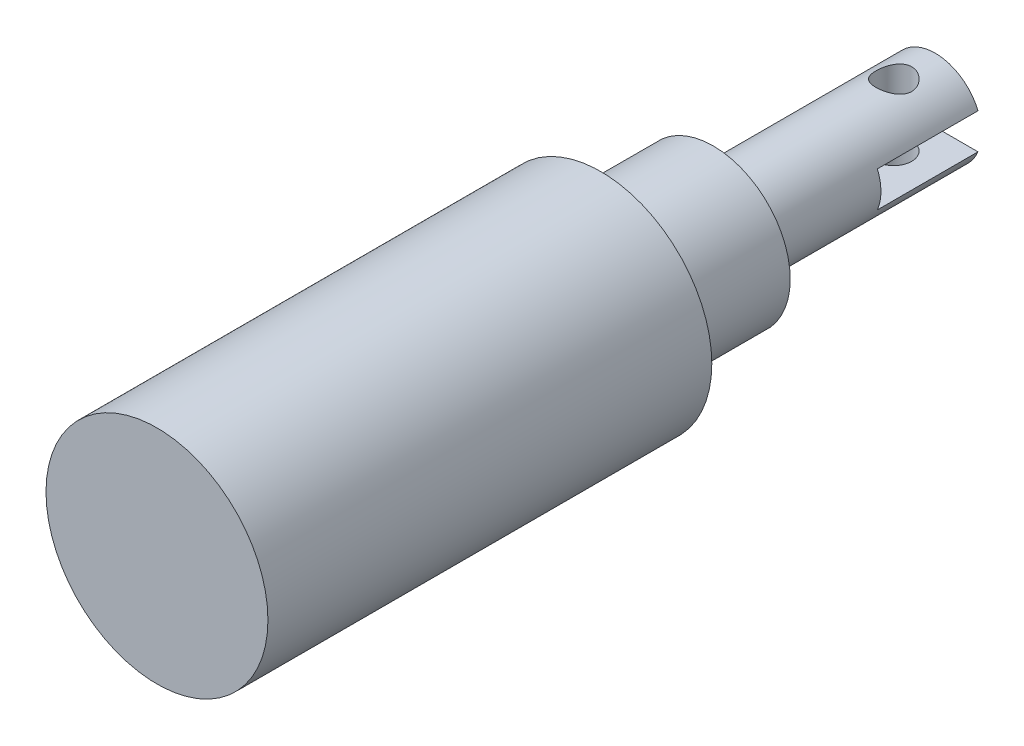
ISO-10303-21;
HEADER;
FILE_DESCRIPTION(('STEP AP214'),'2;1');
FILE_NAME('part.step','',(''),(''),'','','');
FILE_SCHEMA(('AUTOMOTIVE_DESIGN { 1 0 10303 214 1 1 1 1 }'));
ENDSEC;
DATA;
#1=APPLICATION_CONTEXT('core data for automotive mechanical design processes');
#2=APPLICATION_PROTOCOL_DEFINITION('international standard','automotive_design',2000,#1);
#3=PRODUCT_CONTEXT('',#1,'mechanical');
#4=PRODUCT('Part','Part','',(#3));
#5=PRODUCT_RELATED_PRODUCT_CATEGORY('part','',(#4));
#6=PRODUCT_DEFINITION_FORMATION('','',#4);
#7=PRODUCT_DEFINITION_CONTEXT('part definition',#1,'design');
#8=PRODUCT_DEFINITION('design','',#6,#7);
#9=PRODUCT_DEFINITION_SHAPE('','',#8);
#10=(LENGTH_UNIT() NAMED_UNIT(*) SI_UNIT(.MILLI.,.METRE.));
#11=(NAMED_UNIT(*) PLANE_ANGLE_UNIT() SI_UNIT($,.RADIAN.));
#12=(NAMED_UNIT(*) SI_UNIT($,.STERADIAN.) SOLID_ANGLE_UNIT());
#13=UNCERTAINTY_MEASURE_WITH_UNIT(LENGTH_MEASURE(1.E-05),#10,'distance_accuracy_value','');
#14=(GEOMETRIC_REPRESENTATION_CONTEXT(3) GLOBAL_UNCERTAINTY_ASSIGNED_CONTEXT((#13)) GLOBAL_UNIT_ASSIGNED_CONTEXT((#10,
#11,#12)) REPRESENTATION_CONTEXT('',''));
#15=CARTESIAN_POINT('',(0.,0.,0.));
#16=DIRECTION('',(0.,0.,1.));
#17=DIRECTION('',(1.,0.,0.));
#18=AXIS2_PLACEMENT_3D('',#15,#16,#17);
#19=CARTESIAN_POINT('',(0.,0.,-28.702));
#20=DIRECTION('',(0.,0.,-1.));
#21=DIRECTION('',(-1.,0.,0.));
#22=AXIS2_PLACEMENT_3D('',#19,#20,#21);
#23=PLANE('',#22);
#24=DIRECTION('',(1.,0.,0.));
#25=VECTOR('',#24,1.);
#26=CARTESIAN_POINT('',(0.,1.524,-28.702));
#27=LINE('',#26,#25);
#28=CARTESIAN_POINT('',(-3.67135451979239,1.524,-28.702));
#29=VERTEX_POINT('',#28);
#30=CARTESIAN_POINT('',(3.67135451979239,1.524,-28.702));
#31=VERTEX_POINT('',#30);
#32=EDGE_CURVE('E80',#29,#31,#27,.T.);
#33=ORIENTED_EDGE('',*,*,#32,.F.);
#34=CARTESIAN_POINT('',(0.,0.,-28.702));
#35=DIRECTION('',(0.,0.,-1.));
#36=DIRECTION('',(-1.,0.,0.));
#37=AXIS2_PLACEMENT_3D('',#34,#35,#36);
#38=CIRCLE('',#37,3.9751);
#39=EDGE_CURVE('E93',#29,#31,#38,.T.);
#40=ORIENTED_EDGE('',*,*,#39,.T.);
#41=EDGE_LOOP('',(#33,#40));
#42=FACE_BOUND('',#41,.T.);
#43=ADVANCED_FACE('F32',(#42),#23,.T.);
#44=CARTESIAN_POINT('',(0.,0.,-9.652));
#45=DIRECTION('',(0.,0.,-1.));
#46=DIRECTION('',(-1.,0.,0.));
#47=AXIS2_PLACEMENT_3D('',#44,#45,#46);
#48=PLANE('',#47);
#49=CARTESIAN_POINT('',(0.,0.,-9.652));
#50=DIRECTION('',(0.,0.,-1.));
#51=DIRECTION('',(-1.,0.,0.));
#52=AXIS2_PLACEMENT_3D('',#49,#50,#51);
#53=CIRCLE('',#52,6.604);
#54=CARTESIAN_POINT('',(-6.604,0.,-9.652));
#55=VERTEX_POINT('',#54);
#56=EDGE_CURVE('E97',#55,#55,#53,.T.);
#57=ORIENTED_EDGE('',*,*,#56,.T.);
#58=EDGE_LOOP('',(#57));
#59=FACE_BOUND('',#58,.T.);
#60=CARTESIAN_POINT('',(0.,0.,-9.652));
#61=DIRECTION('',(0.,0.,-1.));
#62=DIRECTION('',(-1.,0.,0.));
#63=AXIS2_PLACEMENT_3D('',#60,#61,#62);
#64=CIRCLE('',#63,3.9751);
#65=CARTESIAN_POINT('',(-3.9751,0.,-9.652));
#66=VERTEX_POINT('',#65);
#67=EDGE_CURVE('E94',#66,#66,#64,.T.);
#68=ORIENTED_EDGE('',*,*,#67,.F.);
#69=EDGE_LOOP('',(#68));
#70=FACE_BOUND('',#69,.T.);
#71=ADVANCED_FACE('F159',(#59,#70),#48,.T.);
#72=CARTESIAN_POINT('',(0.,0.,0.));
#73=DIRECTION('',(0.,0.,1.));
#74=DIRECTION('',(1.,0.,0.));
#75=AXIS2_PLACEMENT_3D('',#72,#73,#74);
#76=PLANE('',#75);
#77=CARTESIAN_POINT('',(0.,0.,0.));
#78=DIRECTION('',(0.,0.,1.));
#79=DIRECTION('',(1.,0.,0.));
#80=AXIS2_PLACEMENT_3D('',#77,#78,#79);
#81=CIRCLE('',#80,9.525);
#82=CARTESIAN_POINT('',(9.525,0.,0.));
#83=VERTEX_POINT('',#82);
#84=EDGE_CURVE('E105',#83,#83,#81,.T.);
#85=ORIENTED_EDGE('',*,*,#84,.F.);
#86=EDGE_LOOP('',(#85));
#87=FACE_BOUND('',#86,.T.);
#88=CARTESIAN_POINT('',(0.,0.,0.));
#89=DIRECTION('',(0.,0.,1.));
#90=DIRECTION('',(1.,0.,0.));
#91=AXIS2_PLACEMENT_3D('',#88,#89,#90);
#92=CIRCLE('',#91,6.604);
#93=CARTESIAN_POINT('',(6.604,0.,0.));
#94=VERTEX_POINT('',#93);
#95=EDGE_CURVE('E81',#94,#94,#92,.F.);
#96=ORIENTED_EDGE('',*,*,#95,.F.);
#97=EDGE_LOOP('',(#96));
#98=FACE_BOUND('',#97,.T.);
#99=ADVANCED_FACE('F164',(#87,#98),#76,.F.);
#100=CARTESIAN_POINT('',(0.,0.,38.1));
#101=DIRECTION('',(0.,0.,-1.));
#102=DIRECTION('',(-1.,0.,0.));
#103=AXIS2_PLACEMENT_3D('',#100,#101,#102);
#104=CYLINDRICAL_SURFACE('',#103,9.525);
#105=CARTESIAN_POINT('',(0.,0.,38.1));
#106=DIRECTION('',(0.,0.,1.));
#107=DIRECTION('',(1.,0.,0.));
#108=AXIS2_PLACEMENT_3D('',#105,#106,#107);
#109=CIRCLE('',#108,9.525);
#110=CARTESIAN_POINT('',(9.525,0.,38.1));
#111=VERTEX_POINT('',#110);
#112=EDGE_CURVE('E108',#111,#111,#109,.T.);
#113=ORIENTED_EDGE('',*,*,#112,.F.);
#114=EDGE_LOOP('',(#113));
#115=FACE_BOUND('',#114,.T.);
#116=ORIENTED_EDGE('',*,*,#84,.T.);
#117=EDGE_LOOP('',(#116));
#118=FACE_BOUND('',#117,.T.);
#119=ADVANCED_FACE('F34',(#115,#118),#104,.T.);
#120=CARTESIAN_POINT('',(0.,0.,38.1));
#121=DIRECTION('',(0.,0.,1.));
#122=DIRECTION('',(1.,0.,0.));
#123=AXIS2_PLACEMENT_3D('',#120,#121,#122);
#124=PLANE('',#123);
#125=ORIENTED_EDGE('',*,*,#112,.T.);
#126=EDGE_LOOP('',(#125));
#127=FACE_BOUND('',#126,.T.);
#128=ADVANCED_FACE('F174',(#127),#124,.T.);
#129=CARTESIAN_POINT('',(0.,0.,-9.652));
#130=DIRECTION('',(0.,0.,1.));
#131=DIRECTION('',(1.,0.,0.));
#132=AXIS2_PLACEMENT_3D('',#129,#130,#131);
#133=CYLINDRICAL_SURFACE('',#132,6.604);
#134=ORIENTED_EDGE('',*,*,#56,.F.);
#135=EDGE_LOOP('',(#134));
#136=FACE_BOUND('',#135,.T.);
#137=ORIENTED_EDGE('',*,*,#95,.T.);
#138=EDGE_LOOP('',(#137));
#139=FACE_BOUND('',#138,.T.);
#140=ADVANCED_FACE('F156',(#136,#139),#133,.T.);
#141=CARTESIAN_POINT('',(0.,0.,-28.702));
#142=DIRECTION('',(0.,0.,1.));
#143=DIRECTION('',(1.,0.,0.));
#144=AXIS2_PLACEMENT_3D('',#141,#142,#143);
#145=CYLINDRICAL_SURFACE('',#144,3.9751);
#146=CARTESIAN_POINT('',(0.,-3.9751,-23.6093));
#147=CARTESIAN_POINT('',(0.0830380894982347,-3.9751029806938,-23.6092961033103));
#148=CARTESIAN_POINT('',(0.166050383267687,-3.97247584886368,-23.6160513642807));
#149=CARTESIAN_POINT('',(0.329584181311895,-3.96225958594963,-23.6427763788338));
#150=CARTESIAN_POINT('',(0.410106208687314,-3.95467150447033,-23.6627433371844));
#151=CARTESIAN_POINT('',(0.566276493378778,-3.93534477224999,-23.715073348993));
#152=CARTESIAN_POINT('',(0.641934158795291,-3.92361443706282,-23.7474115779492));
#153=CARTESIAN_POINT('',(0.786742101338885,-3.89716328569474,-23.8234357791034));
#154=CARTESIAN_POINT('',(0.855890516440798,-3.88244161759914,-23.8671249849853));
#155=CARTESIAN_POINT('',(0.988809285528758,-3.85078346873806,-23.9666478095951));
#156=CARTESIAN_POINT('',(1.05225057511994,-3.83378163796224,-24.0228999128649));
#157=CARTESIAN_POINT('',(1.16906783530413,-3.79979056415889,-24.1450633450638));
#158=CARTESIAN_POINT('',(1.2224404378886,-3.78280132723024,-24.2109778930563));
#159=CARTESIAN_POINT('',(1.31976391728373,-3.74998579233273,-24.3538868073146));
#160=CARTESIAN_POINT('',(1.36323872732565,-3.73423574426588,-24.4312246670783));
#161=CARTESIAN_POINT('',(1.4364168594696,-3.70670563656035,-24.592817856327));
#162=CARTESIAN_POINT('',(1.46612607567058,-3.69492387838578,-24.677070206968));
#163=CARTESIAN_POINT('',(1.50961201037139,-3.67736636399404,-24.8463041896061));
#164=CARTESIAN_POINT('',(1.52401948364219,-3.67135391407232,-24.931098328155));
#165=CARTESIAN_POINT('',(1.5384644750005,-3.665325991539,-25.1020975576534));
#166=CARTESIAN_POINT('',(1.5385084162159,-3.66530783837952,-25.1883020006915));
#167=CARTESIAN_POINT('',(1.52470535473133,-3.67106749029638,-25.3537747457893));
#168=CARTESIAN_POINT('',(1.51175051657555,-3.67647304141678,-25.4331328814722));
#169=CARTESIAN_POINT('',(1.47379833169538,-3.69184957167249,-25.5884461994993));
#170=CARTESIAN_POINT('',(1.44879905310381,-3.70182128318405,-25.6644008338024));
#171=CARTESIAN_POINT('',(1.38700403741426,-3.72541918812199,-25.8125088409953));
#172=CARTESIAN_POINT('',(1.34998633026831,-3.73911328823974,-25.8845583027187));
#173=CARTESIAN_POINT('',(1.26536042569286,-3.76859217903469,-26.0216749238049));
#174=CARTESIAN_POINT('',(1.21774841540283,-3.78437772158667,-26.0867395568175));
#175=CARTESIAN_POINT('',(1.10926459633293,-3.81764207808103,-26.2129533862858));
#176=CARTESIAN_POINT('',(1.04768632189708,-3.8351611028321,-26.2734863123813));
#177=CARTESIAN_POINT('',(0.915057315823779,-3.86894932284617,-26.3835559647981));
#178=CARTESIAN_POINT('',(0.844004943543562,-3.88521830086596,-26.433090782593));
#179=CARTESIAN_POINT('',(0.692792686158952,-3.91503390905353,-26.520495718632));
#180=CARTESIAN_POINT('',(0.612496148411962,-3.92852839645976,-26.558148491541));
#181=CARTESIAN_POINT('',(0.446055800553947,-3.95088451493021,-26.6192033656615));
#182=CARTESIAN_POINT('',(0.359914778750758,-3.95974833789132,-26.6426122100161));
#183=CARTESIAN_POINT('',(0.189407865526704,-3.97145261179298,-26.6733019493625));
#184=CARTESIAN_POINT('',(0.105212322456653,-3.97460232999082,-26.6814119426118));
#185=CARTESIAN_POINT('',(-0.0633865089390949,-3.97548764711835,-26.6837034413665));
#186=CARTESIAN_POINT('',(-0.147789742923662,-3.97322453723792,-26.6778882686164));
#187=CARTESIAN_POINT('',(-0.310745600504053,-3.96374191093432,-26.6531156092067));
#188=CARTESIAN_POINT('',(-0.389395821774841,-3.95673125929177,-26.6347116268862));
#189=CARTESIAN_POINT('',(-0.542428899752999,-3.93867137326789,-26.5860236375393));
#190=CARTESIAN_POINT('',(-0.616811202090119,-3.92762161560513,-26.5557380911743));
#191=CARTESIAN_POINT('',(-0.761702917083166,-3.90215385006175,-26.4831678452456));
#192=CARTESIAN_POINT('',(-0.83202912344978,-3.88764471494833,-26.4405503358335));
#193=CARTESIAN_POINT('',(-0.964773399877488,-3.85684886036941,-26.3448987324591));
#194=CARTESIAN_POINT('',(-1.02718841276093,-3.84056145821401,-26.2918606316626));
#195=CARTESIAN_POINT('',(-1.14637181915741,-3.80674721919624,-26.1730288323215));
#196=CARTESIAN_POINT('',(-1.20255429098789,-3.78920590883894,-26.1066500616832));
#197=CARTESIAN_POINT('',(-1.30311142899317,-3.75581359694204,-25.965076563306));
#198=CARTESIAN_POINT('',(-1.34748465650101,-3.73996280149106,-25.8898807630342));
#199=CARTESIAN_POINT('',(-1.42330939759957,-3.71177394459548,-25.7319643908416));
#200=CARTESIAN_POINT('',(-1.45467465840069,-3.69945949220477,-25.6491978973582));
#201=CARTESIAN_POINT('',(-1.50279969909284,-3.68017636919458,-25.4789438370654));
#202=CARTESIAN_POINT('',(-1.51956929909603,-3.67320410467416,-25.3914594866284));
#203=CARTESIAN_POINT('',(-1.53712104106077,-3.66589154637158,-25.2206460734946));
#204=CARTESIAN_POINT('',(-1.53891039165668,-3.6651335118221,-25.1374376284623));
#205=CARTESIAN_POINT('',(-1.52906083673222,-3.66925348245713,-24.9719696492659));
#206=CARTESIAN_POINT('',(-1.51742337900248,-3.67413087998236,-24.8897100137592));
#207=CARTESIAN_POINT('',(-1.48185285694508,-3.68861475037555,-24.7313672590042));
#208=CARTESIAN_POINT('',(-1.45835766006208,-3.69805233538713,-24.6551689664657));
#209=CARTESIAN_POINT('',(-1.4001350818281,-3.72048520812047,-24.5077576051675));
#210=CARTESIAN_POINT('',(-1.36540478108963,-3.73348142039941,-24.4365458379893));
#211=CARTESIAN_POINT('',(-1.28349674615039,-3.76245117349394,-24.2968885113173));
#212=CARTESIAN_POINT('',(-1.23574193058826,-3.77854871045546,-24.2288074854954));
#213=CARTESIAN_POINT('',(-1.13001062675685,-3.81150365272091,-24.1013050558573));
#214=CARTESIAN_POINT('',(-1.07203078869622,-3.82836130569309,-24.0418865016182));
#215=CARTESIAN_POINT('',(-0.943415859281925,-3.86213076265507,-23.9298148872565));
#216=CARTESIAN_POINT('',(-0.872236257382769,-3.8789871869923,-23.8777670658039));
#217=CARTESIAN_POINT('',(-0.721544712543524,-3.90982159606638,-23.7863726296693));
#218=CARTESIAN_POINT('',(-0.642031215521395,-3.92379904249319,-23.7470283895182));
#219=CARTESIAN_POINT('',(-0.471012896609513,-3.94810315731587,-23.6801928342344));
#220=CARTESIAN_POINT('',(-0.379058426185178,-3.95810660587897,-23.6537214590898));
#221=CARTESIAN_POINT('',(-0.191389724843978,-3.97160139486835,-23.6182824346457));
#222=CARTESIAN_POINT('',(-0.0956777392224007,-3.97509656559965,-23.6093044898247));
#223=CARTESIAN_POINT('',(0.,-3.9751,-23.6093));
#224=B_SPLINE_CURVE_WITH_KNOTS('',3,(#146,#147,#148,#149,#150,#151,#152,#153,#154,#155,#156,
#157,#158,#159,#160,#161,#162,#163,#164,#165,#166,#167,#168,#169,#170,#171,#172,#173,#174,#175,
#176,#177,#178,#179,#180,#181,#182,#183,#184,#185,#186,#187,#188,#189,#190,#191,#192,#193,#194,
#195,#196,#197,#198,#199,#200,#201,#202,#203,#204,#205,#206,#207,#208,#209,#210,#211,#212,#213,
#214,#215,#216,#217,#218,#219,#220,#221,#222,#223),.UNSPECIFIED.,.T.,.F.,(4,2,2,2,2,2,2,2,2,2,2,
2,2,2,2,2,2,2,2,2,2,2,2,2,2,2,2,2,2,2,2,2,2,2,2,2,2,2,4),(0.,0.248761156411061,
0.497469698620771,0.745681771788006,0.993964633678405,1.25225386807937,1.51062934846253,
1.77959928462661,2.04845394761117,2.30573600720731,2.56290301447303,2.80354976797622,
3.04423513285523,3.28964601298231,3.53514535907688,3.79826634015716,4.06143294558598,
4.32916650826577,4.59677322580282,4.8494069791102,5.10198047452511,5.34410770606109,
5.58626631721738,5.83569188060921,6.08521353928717,6.35012915480844,6.61507702904576,
6.88175465737973,7.14825272322924,7.39667549323656,7.6450714787292,7.88490126299054,
8.12479341598759,8.37781108018318,8.63091178930224,8.89893144764616,9.16700117478869,
9.45379637185945,9.74042272845772),.UNSPECIFIED.);
#225=CARTESIAN_POINT('',(0.,-3.9751,-23.6093));
#226=VERTEX_POINT('',#225);
#227=EDGE_CURVE('E124',#226,#226,#224,.T.);
#228=ORIENTED_EDGE('',*,*,#227,.T.);
#229=EDGE_LOOP('',(#228));
#230=FACE_BOUND('',#229,.T.);
#231=CARTESIAN_POINT('',(0.,3.9751,-23.6093));
#232=CARTESIAN_POINT('',(-0.0830380894982348,3.9751029806938,-23.6092961033103));
#233=CARTESIAN_POINT('',(-0.166050383267687,3.97247584886368,-23.6160513642807));
#234=CARTESIAN_POINT('',(-0.329584181311895,3.96225958594963,-23.6427763788338));
#235=CARTESIAN_POINT('',(-0.410106208687314,3.95467150447033,-23.6627433371844));
#236=CARTESIAN_POINT('',(-0.566276493378778,3.93534477224999,-23.715073348993));
#237=CARTESIAN_POINT('',(-0.641934158795291,3.92361443706282,-23.7474115779492));
#238=CARTESIAN_POINT('',(-0.786742101338885,3.89716328569474,-23.8234357791034));
#239=CARTESIAN_POINT('',(-0.855890516440799,3.88244161759914,-23.8671249849853));
#240=CARTESIAN_POINT('',(-0.988809285528759,3.85078346873806,-23.9666478095951));
#241=CARTESIAN_POINT('',(-1.05225057511994,3.83378163796224,-24.0228999128649));
#242=CARTESIAN_POINT('',(-1.16906783530413,3.79979056415889,-24.1450633450638));
#243=CARTESIAN_POINT('',(-1.2224404378886,3.78280132723024,-24.2109778930563));
#244=CARTESIAN_POINT('',(-1.31976391728373,3.74998579233273,-24.3538868073146));
#245=CARTESIAN_POINT('',(-1.36323872732565,3.73423574426588,-24.4312246670783));
#246=CARTESIAN_POINT('',(-1.4364168594696,3.70670563656035,-24.592817856327));
#247=CARTESIAN_POINT('',(-1.46612607567059,3.69492387838578,-24.677070206968));
#248=CARTESIAN_POINT('',(-1.50961201037139,3.67736636399404,-24.8463041896061));
#249=CARTESIAN_POINT('',(-1.52401948364219,3.67135391407232,-24.931098328155));
#250=CARTESIAN_POINT('',(-1.5384644750005,3.665325991539,-25.1020975576534));
#251=CARTESIAN_POINT('',(-1.5385084162159,3.66530783837952,-25.1883020006915));
#252=CARTESIAN_POINT('',(-1.52470535473133,3.67106749029638,-25.3537747457893));
#253=CARTESIAN_POINT('',(-1.51175051657555,3.67647304141678,-25.4331328814722));
#254=CARTESIAN_POINT('',(-1.47379833169538,3.69184957167249,-25.5884461994993));
#255=CARTESIAN_POINT('',(-1.44879905310381,3.70182128318405,-25.6644008338024));
#256=CARTESIAN_POINT('',(-1.38700403741427,3.72541918812199,-25.8125088409953));
#257=CARTESIAN_POINT('',(-1.34998633026831,3.73911328823974,-25.8845583027187));
#258=CARTESIAN_POINT('',(-1.26536042569287,3.76859217903469,-26.0216749238049));
#259=CARTESIAN_POINT('',(-1.21774841540283,3.78437772158667,-26.0867395568175));
#260=CARTESIAN_POINT('',(-1.10926459633294,3.81764207808103,-26.2129533862858));
#261=CARTESIAN_POINT('',(-1.04768632189708,3.83516110283209,-26.2734863123813));
#262=CARTESIAN_POINT('',(-0.915057315823782,3.86894932284617,-26.3835559647981));
#263=CARTESIAN_POINT('',(-0.844004943543565,3.88521830086596,-26.433090782593));
#264=CARTESIAN_POINT('',(-0.692792686158953,3.91503390905353,-26.520495718632));
#265=CARTESIAN_POINT('',(-0.612496148411963,3.92852839645976,-26.558148491541));
#266=CARTESIAN_POINT('',(-0.446055800553948,3.95088451493021,-26.6192033656615));
#267=CARTESIAN_POINT('',(-0.359914778750758,3.95974833789132,-26.6426122100161));
#268=CARTESIAN_POINT('',(-0.189407865526704,3.97145261179298,-26.6733019493625));
#269=CARTESIAN_POINT('',(-0.105212322456652,3.97460232999082,-26.6814119426118));
#270=CARTESIAN_POINT('',(0.0633865089390958,3.97548764711835,-26.6837034413665));
#271=CARTESIAN_POINT('',(0.147789742923663,3.97322453723792,-26.6778882686164));
#272=CARTESIAN_POINT('',(0.310745600504054,3.96374191093432,-26.6531156092067));
#273=CARTESIAN_POINT('',(0.389395821774842,3.95673125929177,-26.6347116268862));
#274=CARTESIAN_POINT('',(0.542428899753,3.93867137326789,-26.5860236375393));
#275=CARTESIAN_POINT('',(0.61681120209012,3.92762161560513,-26.5557380911743));
#276=CARTESIAN_POINT('',(0.761702917083166,3.90215385006175,-26.4831678452456));
#277=CARTESIAN_POINT('',(0.832029123449781,3.88764471494833,-26.4405503358335));
#278=CARTESIAN_POINT('',(0.96477339987749,3.85684886036941,-26.3448987324591));
#279=CARTESIAN_POINT('',(1.02718841276093,3.84056145821401,-26.2918606316626));
#280=CARTESIAN_POINT('',(1.14637181915741,3.80674721919624,-26.1730288323215));
#281=CARTESIAN_POINT('',(1.20255429098789,3.78920590883894,-26.1066500616832));
#282=CARTESIAN_POINT('',(1.30311142899317,3.75581359694204,-25.965076563306));
#283=CARTESIAN_POINT('',(1.34748465650102,3.73996280149106,-25.8898807630342));
#284=CARTESIAN_POINT('',(1.42330939759958,3.71177394459548,-25.7319643908416));
#285=CARTESIAN_POINT('',(1.45467465840069,3.69945949220477,-25.6491978973582));
#286=CARTESIAN_POINT('',(1.50279969909284,3.68017636919458,-25.4789438370654));
#287=CARTESIAN_POINT('',(1.51956929909603,3.67320410467416,-25.3914594866284));
#288=CARTESIAN_POINT('',(1.53712104106077,3.66589154637158,-25.2206460734946));
#289=CARTESIAN_POINT('',(1.53891039165668,3.6651335118221,-25.1374376284623));
#290=CARTESIAN_POINT('',(1.52906083673222,3.66925348245713,-24.9719696492659));
#291=CARTESIAN_POINT('',(1.51742337900248,3.67413087998236,-24.8897100137592));
#292=CARTESIAN_POINT('',(1.48185285694508,3.68861475037555,-24.7313672590042));
#293=CARTESIAN_POINT('',(1.45835766006208,3.69805233538713,-24.6551689664657));
#294=CARTESIAN_POINT('',(1.4001350818281,3.72048520812047,-24.5077576051675));
#295=CARTESIAN_POINT('',(1.36540478108963,3.73348142039941,-24.4365458379893));
#296=CARTESIAN_POINT('',(1.28349674615038,3.76245117349394,-24.2968885113173));
#297=CARTESIAN_POINT('',(1.23574193058825,3.77854871045546,-24.2288074854954));
#298=CARTESIAN_POINT('',(1.13001062675684,3.81150365272091,-24.1013050558573));
#299=CARTESIAN_POINT('',(1.07203078869622,3.82836130569309,-24.0418865016182));
#300=CARTESIAN_POINT('',(0.943415859281922,3.86213076265507,-23.9298148872565));
#301=CARTESIAN_POINT('',(0.872236257382767,3.8789871869923,-23.8777670658039));
#302=CARTESIAN_POINT('',(0.721544712543523,3.90982159606638,-23.7863726296693));
#303=CARTESIAN_POINT('',(0.642031215521395,3.92379904249319,-23.7470283895182));
#304=CARTESIAN_POINT('',(0.471012896609513,3.94810315731587,-23.6801928342344));
#305=CARTESIAN_POINT('',(0.379058426185177,3.95810660587897,-23.6537214590898));
#306=CARTESIAN_POINT('',(0.191389724843977,3.97160139486835,-23.6182824346457));
#307=CARTESIAN_POINT('',(0.0956777392224002,3.97509656559965,-23.6093044898247));
#308=CARTESIAN_POINT('',(0.,3.9751,-23.6093));
#309=B_SPLINE_CURVE_WITH_KNOTS('',3,(#231,#232,#233,#234,#235,#236,#237,#238,#239,#240,#241,
#242,#243,#244,#245,#246,#247,#248,#249,#250,#251,#252,#253,#254,#255,#256,#257,#258,#259,#260,
#261,#262,#263,#264,#265,#266,#267,#268,#269,#270,#271,#272,#273,#274,#275,#276,#277,#278,#279,
#280,#281,#282,#283,#284,#285,#286,#287,#288,#289,#290,#291,#292,#293,#294,#295,#296,#297,#298,
#299,#300,#301,#302,#303,#304,#305,#306,#307,#308),.UNSPECIFIED.,.T.,.F.,(4,2,2,2,2,2,2,2,2,2,2,
2,2,2,2,2,2,2,2,2,2,2,2,2,2,2,2,2,2,2,2,2,2,2,2,2,2,2,4),(0.,0.248761156411061,
0.497469698620772,0.745681771788007,0.993964633678406,1.25225386807937,1.51062934846253,
1.77959928462661,2.04845394761117,2.30573600720731,2.56290301447303,2.80354976797622,
3.04423513285523,3.28964601298231,3.53514535907687,3.79826634015716,4.06143294558598,
4.32916650826577,4.59677322580282,4.8494069791102,5.10198047452511,5.34410770606109,
5.58626631721738,5.83569188060921,6.08521353928717,6.35012915480845,6.61507702904577,
6.88175465737974,7.14825272322924,7.39667549323656,7.6450714787292,7.88490126299054,
8.1247934159876,8.3778110801832,8.63091178930224,8.89893144764616,9.16700117478869,
9.45379637185945,9.74042272845772),.UNSPECIFIED.);
#310=CARTESIAN_POINT('',(0.,3.9751,-23.6093));
#311=VERTEX_POINT('',#310);
#312=EDGE_CURVE('E131',#311,#311,#309,.T.);
#313=ORIENTED_EDGE('',*,*,#312,.T.);
#314=EDGE_LOOP('',(#313));
#315=FACE_BOUND('',#314,.T.);
#316=CARTESIAN_POINT('',(0.,0.,-20.066));
#317=DIRECTION('',(0.,0.,-1.));
#318=DIRECTION('',(-1.,0.,0.));
#319=AXIS2_PLACEMENT_3D('',#316,#317,#318);
#320=CIRCLE('',#319,3.9751);
#321=CARTESIAN_POINT('',(3.67135451979239,1.524,-20.066));
#322=VERTEX_POINT('',#321);
#323=CARTESIAN_POINT('',(3.67135451979239,-1.524,-20.066));
#324=VERTEX_POINT('',#323);
#325=EDGE_CURVE('E11',#322,#324,#320,.T.);
#326=ORIENTED_EDGE('',*,*,#325,.F.);
#327=DIRECTION('',(0.,0.,1.));
#328=VECTOR('',#327,1.);
#329=CARTESIAN_POINT('',(3.67135451979239,1.524,-28.702));
#330=LINE('',#329,#328);
#331=EDGE_CURVE('E56',#322,#31,#330,.F.);
#332=ORIENTED_EDGE('',*,*,#331,.T.);
#333=ORIENTED_EDGE('',*,*,#39,.F.);
#334=DIRECTION('',(0.,0.,1.));
#335=VECTOR('',#334,1.);
#336=CARTESIAN_POINT('',(-3.67135451979239,1.524,-28.702));
#337=LINE('',#336,#335);
#338=CARTESIAN_POINT('',(-3.67135451979239,1.524,-20.066));
#339=VERTEX_POINT('',#338);
#340=EDGE_CURVE('E99',#29,#339,#337,.T.);
#341=ORIENTED_EDGE('',*,*,#340,.T.);
#342=CARTESIAN_POINT('',(-3.67135451979239,-1.524,-20.066));
#343=VERTEX_POINT('',#342);
#344=EDGE_CURVE('E41',#343,#339,#320,.T.);
#345=ORIENTED_EDGE('',*,*,#344,.F.);
#346=DIRECTION('',(0.,0.,1.));
#347=VECTOR('',#346,1.);
#348=CARTESIAN_POINT('',(-3.67135451979239,-1.524,-28.702));
#349=LINE('',#348,#347);
#350=CARTESIAN_POINT('',(-3.67135451979239,-1.524,-28.702));
#351=VERTEX_POINT('',#350);
#352=EDGE_CURVE('E75',#343,#351,#349,.F.);
#353=ORIENTED_EDGE('',*,*,#352,.T.);
#354=CARTESIAN_POINT('',(3.67135451979239,-1.524,-28.702));
#355=VERTEX_POINT('',#354);
#356=EDGE_CURVE('E88',#355,#351,#38,.T.);
#357=ORIENTED_EDGE('',*,*,#356,.F.);
#358=DIRECTION('',(0.,0.,1.));
#359=VECTOR('',#358,1.);
#360=CARTESIAN_POINT('',(3.67135451979239,-1.524,-28.702));
#361=LINE('',#360,#359);
#362=EDGE_CURVE('E48',#355,#324,#361,.T.);
#363=ORIENTED_EDGE('',*,*,#362,.T.);
#364=EDGE_LOOP('',(#326,#332,#333,#341,#345,#353,#357,#363));
#365=FACE_BOUND('',#364,.T.);
#366=ORIENTED_EDGE('',*,*,#67,.T.);
#367=EDGE_LOOP('',(#366));
#368=FACE_BOUND('',#367,.T.);
#369=ADVANCED_FACE('F86',(#230,#315,#365,#368),#145,.T.);
#370=DIRECTION('',(-1.,0.,0.));
#371=VECTOR('',#370,1.);
#372=CARTESIAN_POINT('',(0.,-1.524,-28.702));
#373=LINE('',#372,#371);
#374=EDGE_CURVE('E72',#355,#351,#373,.T.);
#375=ORIENTED_EDGE('',*,*,#374,.F.);
#376=ORIENTED_EDGE('',*,*,#356,.T.);
#377=EDGE_LOOP('',(#375,#376));
#378=FACE_BOUND('',#377,.T.);
#379=ADVANCED_FACE('F92',(#378),#23,.T.);
#380=CARTESIAN_POINT('',(5.01600775193798,-1.524,-20.066));
#381=DIRECTION('',(0.,0.,-1.));
#382=DIRECTION('',(-1.,0.,0.));
#383=AXIS2_PLACEMENT_3D('',#380,#381,#382);
#384=PLANE('',#383);
#385=ORIENTED_EDGE('',*,*,#325,.T.);
#386=DIRECTION('',(-1.,0.,0.));
#387=VECTOR('',#386,1.);
#388=CARTESIAN_POINT('',(5.01600775193798,-1.524,-20.066));
#389=LINE('',#388,#387);
#390=EDGE_CURVE('E115',#324,#343,#389,.T.);
#391=ORIENTED_EDGE('',*,*,#390,.T.);
#392=ORIENTED_EDGE('',*,*,#344,.T.);
#393=DIRECTION('',(1.,0.,0.));
#394=VECTOR('',#393,1.);
#395=CARTESIAN_POINT('',(5.01600775193798,1.524,-20.066));
#396=LINE('',#395,#394);
#397=EDGE_CURVE('E90',#339,#322,#396,.T.);
#398=ORIENTED_EDGE('',*,*,#397,.T.);
#399=EDGE_LOOP('',(#385,#391,#392,#398));
#400=FACE_BOUND('',#399,.T.);
#401=ADVANCED_FACE('F114',(#400),#384,.T.);
#402=CARTESIAN_POINT('',(5.01600775193798,1.524,-20.066));
#403=DIRECTION('',(0.,1.,0.));
#404=DIRECTION('',(0.,0.,1.));
#405=AXIS2_PLACEMENT_3D('',#402,#403,#404);
#406=PLANE('',#405);
#407=CARTESIAN_POINT('',(0.,1.524,-25.146));
#408=DIRECTION('',(0.,1.,0.));
#409=DIRECTION('',(0.,0.,1.));
#410=AXIS2_PLACEMENT_3D('',#407,#408,#409);
#411=CIRCLE('',#410,1.5367);
#412=CARTESIAN_POINT('',(0.,1.524,-23.6093));
#413=VERTEX_POINT('',#412);
#414=EDGE_CURVE('E259',#413,#413,#411,.T.);
#415=ORIENTED_EDGE('',*,*,#414,.T.);
#416=EDGE_LOOP('',(#415));
#417=FACE_BOUND('',#416,.T.);
#418=ORIENTED_EDGE('',*,*,#32,.T.);
#419=ORIENTED_EDGE('',*,*,#331,.F.);
#420=ORIENTED_EDGE('',*,*,#397,.F.);
#421=ORIENTED_EDGE('',*,*,#340,.F.);
#422=EDGE_LOOP('',(#418,#419,#420,#421));
#423=FACE_BOUND('',#422,.T.);
#424=ADVANCED_FACE('F116',(#417,#423),#406,.F.);
#425=CARTESIAN_POINT('',(5.01600775193798,-1.524,-20.066));
#426=DIRECTION('',(0.,-1.,0.));
#427=DIRECTION('',(0.,0.,-1.));
#428=AXIS2_PLACEMENT_3D('',#425,#426,#427);
#429=PLANE('',#428);
#430=CARTESIAN_POINT('',(0.,-1.524,-25.146));
#431=DIRECTION('',(0.,-1.,0.));
#432=DIRECTION('',(0.,0.,-1.));
#433=AXIS2_PLACEMENT_3D('',#430,#431,#432);
#434=CIRCLE('',#433,1.5367);
#435=CARTESIAN_POINT('',(0.,-1.524,-26.6827));
#436=VERTEX_POINT('',#435);
#437=EDGE_CURVE('E36',#436,#436,#434,.T.);
#438=ORIENTED_EDGE('',*,*,#437,.T.);
#439=EDGE_LOOP('',(#438));
#440=FACE_BOUND('',#439,.T.);
#441=ORIENTED_EDGE('',*,*,#374,.T.);
#442=ORIENTED_EDGE('',*,*,#352,.F.);
#443=ORIENTED_EDGE('',*,*,#390,.F.);
#444=ORIENTED_EDGE('',*,*,#362,.F.);
#445=EDGE_LOOP('',(#441,#442,#443,#444));
#446=FACE_BOUND('',#445,.T.);
#447=ADVANCED_FACE('F74',(#440,#446),#429,.F.);
#448=CARTESIAN_POINT('',(0.,-9.525,-25.146));
#449=DIRECTION('',(0.,1.,0.));
#450=DIRECTION('',(0.,0.,1.));
#451=AXIS2_PLACEMENT_3D('',#448,#449,#450);
#452=CYLINDRICAL_SURFACE('',#451,1.5367);
#453=ORIENTED_EDGE('',*,*,#437,.F.);
#454=EDGE_LOOP('',(#453));
#455=FACE_BOUND('',#454,.T.);
#456=ORIENTED_EDGE('',*,*,#227,.F.);
#457=EDGE_LOOP('',(#456));
#458=FACE_BOUND('',#457,.T.);
#459=ADVANCED_FACE('F138',(#455,#458),#452,.F.);
#460=ORIENTED_EDGE('',*,*,#414,.F.);
#461=EDGE_LOOP('',(#460));
#462=FACE_BOUND('',#461,.T.);
#463=ORIENTED_EDGE('',*,*,#312,.F.);
#464=EDGE_LOOP('',(#463));
#465=FACE_BOUND('',#464,.T.);
#466=ADVANCED_FACE('F142',(#462,#465),#452,.F.);
#467=CLOSED_SHELL('',(#43,#71,#99,#119,#128,#140,#369,#379,#401,#424,#447,#459,#466));
#468=MANIFOLD_SOLID_BREP('B2',#467);
#469=ADVANCED_BREP_SHAPE_REPRESENTATION('',(#18,#468),#14);
#470=SHAPE_DEFINITION_REPRESENTATION(#9,#469);
ENDSEC;
END-ISO-10303-21;
